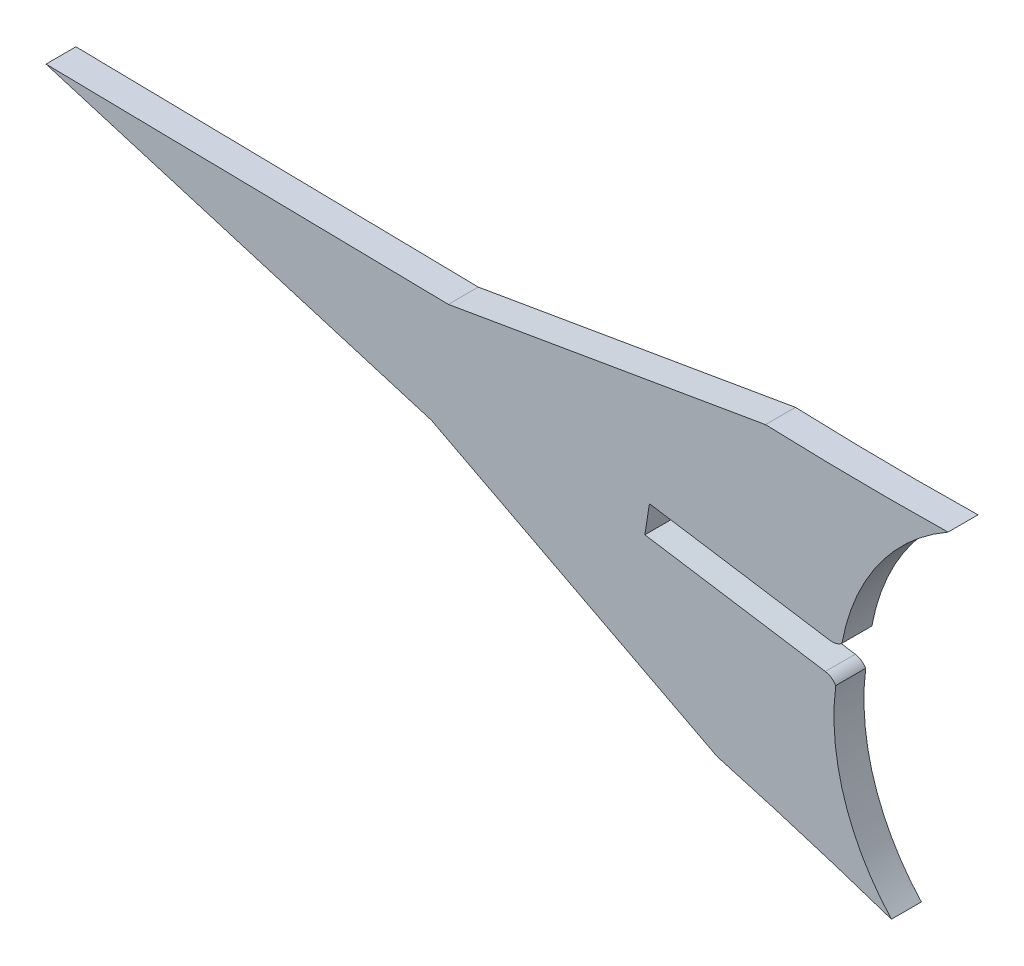
ISO-10303-21;
HEADER;
FILE_DESCRIPTION(('STEP AP214'),'2;1');
FILE_NAME('part.step','',(''),(''),'','','');
FILE_SCHEMA(('AUTOMOTIVE_DESIGN { 1 0 10303 214 1 1 1 1 }'));
ENDSEC;
DATA;
#1=APPLICATION_CONTEXT('core data for automotive mechanical design processes');
#2=APPLICATION_PROTOCOL_DEFINITION('international standard','automotive_design',2000,#1);
#3=PRODUCT_CONTEXT('',#1,'mechanical');
#4=PRODUCT('Part','Part','',(#3));
#5=PRODUCT_RELATED_PRODUCT_CATEGORY('part','',(#4));
#6=PRODUCT_DEFINITION_FORMATION('','',#4);
#7=PRODUCT_DEFINITION_CONTEXT('part definition',#1,'design');
#8=PRODUCT_DEFINITION('design','',#6,#7);
#9=PRODUCT_DEFINITION_SHAPE('','',#8);
#10=(LENGTH_UNIT() NAMED_UNIT(*) SI_UNIT(.MILLI.,.METRE.));
#11=(NAMED_UNIT(*) PLANE_ANGLE_UNIT() SI_UNIT($,.RADIAN.));
#12=(NAMED_UNIT(*) SI_UNIT($,.STERADIAN.) SOLID_ANGLE_UNIT());
#13=UNCERTAINTY_MEASURE_WITH_UNIT(LENGTH_MEASURE(1.E-05),#10,'distance_accuracy_value','');
#14=(GEOMETRIC_REPRESENTATION_CONTEXT(3) GLOBAL_UNCERTAINTY_ASSIGNED_CONTEXT((#13)) GLOBAL_UNIT_ASSIGNED_CONTEXT((#10,
#11,#12)) REPRESENTATION_CONTEXT('',''));
#15=CARTESIAN_POINT('',(0.,0.,0.));
#16=DIRECTION('',(0.,0.,1.));
#17=DIRECTION('',(1.,0.,0.));
#18=AXIS2_PLACEMENT_3D('',#15,#16,#17);
#19=CARTESIAN_POINT('',(252.079097865893,224.29847100034,1.524));
#20=DIRECTION('',(0.,0.,-1.));
#21=DIRECTION('',(-1.,0.,0.));
#22=AXIS2_PLACEMENT_3D('',#19,#20,#21);
#23=CYLINDRICAL_SURFACE('',#22,0.76200000000001);
#24=CARTESIAN_POINT('',(252.079097865893,224.29847100034,0.));
#25=DIRECTION('',(0.,0.,1.));
#26=DIRECTION('',(-1.,0.,0.));
#27=AXIS2_PLACEMENT_3D('',#24,#25,#26);
#28=CIRCLE('',#27,0.76200000000001);
#29=CARTESIAN_POINT('',(252.728179766503,224.697640997085,0.));
#30=VERTEX_POINT('',#29);
#31=CARTESIAN_POINT('',(252.196474719984,225.051376488515,0.));
#32=VERTEX_POINT('',#31);
#33=EDGE_CURVE('E158',#30,#32,#28,.T.);
#34=ORIENTED_EDGE('',*,*,#33,.T.);
#35=DIRECTION('',(0.,0.,-1.));
#36=VECTOR('',#35,1.);
#37=CARTESIAN_POINT('',(252.196474719984,225.051376488515,1.524));
#38=LINE('',#37,#36);
#39=CARTESIAN_POINT('',(252.196474719984,225.051376488515,1.524));
#40=VERTEX_POINT('',#39);
#41=EDGE_CURVE('E11',#40,#32,#38,.T.);
#42=ORIENTED_EDGE('',*,*,#41,.F.);
#43=CARTESIAN_POINT('',(252.079097865893,224.29847100034,1.524));
#44=DIRECTION('',(0.,0.,1.));
#45=DIRECTION('',(-1.,0.,0.));
#46=AXIS2_PLACEMENT_3D('',#43,#44,#45);
#47=CIRCLE('',#46,0.76200000000001);
#48=CARTESIAN_POINT('',(252.728179766503,224.697640997085,1.524));
#49=VERTEX_POINT('',#48);
#50=EDGE_CURVE('E182',#49,#40,#47,.T.);
#51=ORIENTED_EDGE('',*,*,#50,.F.);
#52=DIRECTION('',(0.,0.,-1.));
#53=VECTOR('',#52,1.);
#54=CARTESIAN_POINT('',(252.728179766503,224.697640997085,1.524));
#55=LINE('',#54,#53);
#56=EDGE_CURVE('E154',#49,#30,#55,.T.);
#57=ORIENTED_EDGE('',*,*,#56,.T.);
#58=EDGE_LOOP('',(#34,#42,#51,#57));
#59=FACE_BOUND('',#58,.T.);
#60=ADVANCED_FACE('F32',(#59),#23,.T.);
#61=CARTESIAN_POINT('',(243.009394748598,226.483628693146,1.524));
#62=DIRECTION('',(-0.154037866260265,-0.988064945111395,0.));
#63=DIRECTION('',(0.988064945111395,-0.154037866260265,0.));
#64=AXIS2_PLACEMENT_3D('',#61,#62,#63);
#65=PLANE('',#64);
#66=DIRECTION('',(-0.988064945111395,0.154037866260265,0.));
#67=VECTOR('',#66,1.);
#68=CARTESIAN_POINT('',(243.009394748598,226.483628693146,0.));
#69=LINE('',#68,#67);
#70=CARTESIAN_POINT('',(243.009394748598,226.483628693146,0.));
#71=VERTEX_POINT('',#70);
#72=EDGE_CURVE('E161',#32,#71,#69,.T.);
#73=ORIENTED_EDGE('',*,*,#72,.T.);
#74=DIRECTION('',(0.,0.,-1.));
#75=VECTOR('',#74,1.);
#76=CARTESIAN_POINT('',(243.009394748598,226.483628693146,1.524));
#77=LINE('',#76,#75);
#78=CARTESIAN_POINT('',(243.009394748598,226.483628693146,1.524));
#79=VERTEX_POINT('',#78);
#80=EDGE_CURVE('E40',#79,#71,#77,.T.);
#81=ORIENTED_EDGE('',*,*,#80,.F.);
#82=DIRECTION('',(-0.988064945111395,0.154037866260265,0.));
#83=VECTOR('',#82,1.);
#84=CARTESIAN_POINT('',(243.009394748598,226.483628693146,1.524));
#85=LINE('',#84,#83);
#86=EDGE_CURVE('E106',#40,#79,#85,.T.);
#87=ORIENTED_EDGE('',*,*,#86,.F.);
#88=ORIENTED_EDGE('',*,*,#41,.T.);
#89=EDGE_LOOP('',(#73,#81,#87,#88));
#90=FACE_BOUND('',#89,.T.);
#91=ADVANCED_FACE('F265',(#90),#65,.F.);
#92=CARTESIAN_POINT('',(243.009394748598,226.483628693146,1.524));
#93=DIRECTION('',(-0.98808512969779,0.153908337883631,0.));
#94=DIRECTION('',(-0.153908337883631,-0.98808512969779,0.));
#95=AXIS2_PLACEMENT_3D('',#92,#93,#94);
#96=PLANE('',#95);
#97=DIRECTION('',(0.153908337883631,0.98808512969779,0.));
#98=VECTOR('',#97,1.);
#99=CARTESIAN_POINT('',(243.009394748598,226.483628693146,0.));
#100=LINE('',#99,#98);
#101=CARTESIAN_POINT('',(243.241260725701,227.972198625155,0.));
#102=VERTEX_POINT('',#101);
#103=EDGE_CURVE('E163',#71,#102,#100,.T.);
#104=ORIENTED_EDGE('',*,*,#103,.T.);
#105=DIRECTION('',(0.,0.,-1.));
#106=VECTOR('',#105,1.);
#107=CARTESIAN_POINT('',(243.241260725701,227.972198625155,1.524));
#108=LINE('',#107,#106);
#109=CARTESIAN_POINT('',(243.241260725701,227.972198625155,1.524));
#110=VERTEX_POINT('',#109);
#111=EDGE_CURVE('E204',#110,#102,#108,.T.);
#112=ORIENTED_EDGE('',*,*,#111,.F.);
#113=DIRECTION('',(0.153908337883631,0.98808512969779,0.));
#114=VECTOR('',#113,1.);
#115=CARTESIAN_POINT('',(243.009394748598,226.483628693146,1.524));
#116=LINE('',#115,#114);
#117=EDGE_CURVE('E212',#79,#110,#116,.T.);
#118=ORIENTED_EDGE('',*,*,#117,.F.);
#119=ORIENTED_EDGE('',*,*,#80,.T.);
#120=EDGE_LOOP('',(#104,#112,#118,#119));
#121=FACE_BOUND('',#120,.T.);
#122=ADVANCED_FACE('F210',(#121),#96,.F.);
#123=CARTESIAN_POINT('',(243.241260725701,227.972198625155,1.524));
#124=DIRECTION('',(0.153778806862073,0.988105297303925,0.));
#125=DIRECTION('',(-0.988105297303925,0.153778806862073,0.));
#126=AXIS2_PLACEMENT_3D('',#123,#124,#125);
#127=PLANE('',#126);
#128=DIRECTION('',(0.988105297303924,-0.153778806862073,0.));
#129=VECTOR('',#128,1.);
#130=CARTESIAN_POINT('',(243.241260725701,227.972198625155,0.));
#131=LINE('',#130,#129);
#132=CARTESIAN_POINT('',(252.428715893902,226.542355168472,0.));
#133=VERTEX_POINT('',#132);
#134=EDGE_CURVE('E165',#102,#133,#131,.T.);
#135=ORIENTED_EDGE('',*,*,#134,.T.);
#136=DIRECTION('',(0.,0.,-1.));
#137=VECTOR('',#136,1.);
#138=CARTESIAN_POINT('',(252.428715893902,226.542355168472,1.524));
#139=LINE('',#138,#137);
#140=CARTESIAN_POINT('',(252.428715893902,226.542355168472,1.524));
#141=VERTEX_POINT('',#140);
#142=EDGE_CURVE('E201',#141,#133,#139,.T.);
#143=ORIENTED_EDGE('',*,*,#142,.F.);
#144=DIRECTION('',(0.988105297303924,-0.153778806862073,0.));
#145=VECTOR('',#144,1.);
#146=CARTESIAN_POINT('',(243.241260725701,227.972198625155,1.524));
#147=LINE('',#146,#145);
#148=EDGE_CURVE('E230',#110,#141,#147,.T.);
#149=ORIENTED_EDGE('',*,*,#148,.F.);
#150=ORIENTED_EDGE('',*,*,#111,.T.);
#151=EDGE_LOOP('',(#135,#143,#149,#150));
#152=FACE_BOUND('',#151,.T.);
#153=ADVANCED_FACE('F221',(#152),#127,.F.);
#154=CARTESIAN_POINT('',(252.545895344731,227.295291405017,1.524));
#155=DIRECTION('',(0.,0.,-1.));
#156=DIRECTION('',(-1.,0.,0.));
#157=AXIS2_PLACEMENT_3D('',#154,#155,#156);
#158=CYLINDRICAL_SURFACE('',#157,0.762000000000013);
#159=CARTESIAN_POINT('',(252.545895344731,227.295291405017,0.));
#160=DIRECTION('',(0.,0.,1.));
#161=DIRECTION('',(1.,0.,0.));
#162=AXIS2_PLACEMENT_3D('',#159,#160,#161);
#163=CIRCLE('',#162,0.762000000000013);
#164=CARTESIAN_POINT('',(253.042819444123,226.717614644671,0.));
#165=VERTEX_POINT('',#164);
#166=EDGE_CURVE('E167',#133,#165,#163,.T.);
#167=ORIENTED_EDGE('',*,*,#166,.T.);
#168=DIRECTION('',(0.,0.,-1.));
#169=VECTOR('',#168,1.);
#170=CARTESIAN_POINT('',(253.042819444123,226.717614644671,1.524));
#171=LINE('',#170,#169);
#172=CARTESIAN_POINT('',(253.042819444123,226.717614644671,1.524));
#173=VERTEX_POINT('',#172);
#174=EDGE_CURVE('E198',#173,#165,#171,.T.);
#175=ORIENTED_EDGE('',*,*,#174,.F.);
#176=CARTESIAN_POINT('',(252.545895344731,227.295291405017,1.524));
#177=DIRECTION('',(0.,0.,1.));
#178=DIRECTION('',(1.,0.,0.));
#179=AXIS2_PLACEMENT_3D('',#176,#177,#178);
#180=CIRCLE('',#179,0.762000000000013);
#181=EDGE_CURVE('E227',#141,#173,#180,.T.);
#182=ORIENTED_EDGE('',*,*,#181,.F.);
#183=ORIENTED_EDGE('',*,*,#142,.T.);
#184=EDGE_LOOP('',(#167,#175,#182,#183));
#185=FACE_BOUND('',#184,.T.);
#186=ADVANCED_FACE('F225',(#185),#158,.T.);
#187=CARTESIAN_POINT('',(263.885158278804,224.734496792459,1.524));
#188=DIRECTION('',(0.,0.,-1.));
#189=DIRECTION('',(-1.,0.,0.));
#190=AXIS2_PLACEMENT_3D('',#187,#188,#189);
#191=CYLINDRICAL_SURFACE('',#190,11.0222079376955);
#192=CARTESIAN_POINT('',(263.885158278804,224.734496792459,0.));
#193=DIRECTION('',(0.,0.,-1.));
#194=DIRECTION('',(-1.,0.,0.));
#195=AXIS2_PLACEMENT_3D('',#192,#193,#194);
#196=CIRCLE('',#195,11.0222079376955);
#197=CARTESIAN_POINT('',(258.445341479294,234.320813134494,0.));
#198=VERTEX_POINT('',#197);
#199=EDGE_CURVE('E169',#165,#198,#196,.T.);
#200=ORIENTED_EDGE('',*,*,#199,.T.);
#201=DIRECTION('',(0.,0.,-1.));
#202=VECTOR('',#201,1.);
#203=CARTESIAN_POINT('',(258.445341479294,234.320813134494,1.524));
#204=LINE('',#203,#202);
#205=CARTESIAN_POINT('',(258.445341479294,234.320813134494,1.524));
#206=VERTEX_POINT('',#205);
#207=EDGE_CURVE('E195',#206,#198,#204,.T.);
#208=ORIENTED_EDGE('',*,*,#207,.F.);
#209=CARTESIAN_POINT('',(263.885158278804,224.734496792459,1.524));
#210=DIRECTION('',(0.,0.,-1.));
#211=DIRECTION('',(-1.,0.,0.));
#212=AXIS2_PLACEMENT_3D('',#209,#210,#211);
#213=CIRCLE('',#212,11.0222079376955);
#214=EDGE_CURVE('E229',#173,#206,#213,.T.);
#215=ORIENTED_EDGE('',*,*,#214,.F.);
#216=ORIENTED_EDGE('',*,*,#174,.T.);
#217=EDGE_LOOP('',(#200,#208,#215,#216));
#218=FACE_BOUND('',#217,.T.);
#219=ADVANCED_FACE('F278',(#218),#191,.F.);
#220=CARTESIAN_POINT('',(255.464366720967,401.084428898989,1.524));
#221=DIRECTION('',(0.,0.,-1.));
#222=DIRECTION('',(-1.,0.,0.));
#223=AXIS2_PLACEMENT_3D('',#220,#221,#222);
#224=CYLINDRICAL_SURFACE('',#223,166.790256769866);
#225=CARTESIAN_POINT('',(255.464366720967,401.084428898989,0.));
#226=DIRECTION('',(0.,0.,-1.));
#227=DIRECTION('',(-1.,0.,0.));
#228=AXIS2_PLACEMENT_3D('',#225,#226,#227);
#229=CIRCLE('',#228,166.790256769866);
#230=CARTESIAN_POINT('',(249.153153431749,234.413620596587,0.));
#231=VERTEX_POINT('',#230);
#232=EDGE_CURVE('E171',#198,#231,#229,.T.);
#233=ORIENTED_EDGE('',*,*,#232,.T.);
#234=DIRECTION('',(0.,0.,-1.));
#235=VECTOR('',#234,1.);
#236=CARTESIAN_POINT('',(249.153153431749,234.413620596587,1.524));
#237=LINE('',#236,#235);
#238=CARTESIAN_POINT('',(249.153153431749,234.413620596587,1.524));
#239=VERTEX_POINT('',#238);
#240=EDGE_CURVE('E192',#239,#231,#237,.T.);
#241=ORIENTED_EDGE('',*,*,#240,.F.);
#242=CARTESIAN_POINT('',(255.464366720967,401.084428898989,1.524));
#243=DIRECTION('',(0.,0.,-1.));
#244=DIRECTION('',(-1.,0.,0.));
#245=AXIS2_PLACEMENT_3D('',#242,#243,#244);
#246=CIRCLE('',#245,166.790256769866);
#247=EDGE_CURVE('E232',#206,#239,#246,.T.);
#248=ORIENTED_EDGE('',*,*,#247,.F.);
#249=ORIENTED_EDGE('',*,*,#207,.T.);
#250=EDGE_LOOP('',(#233,#241,#248,#249));
#251=FACE_BOUND('',#250,.T.);
#252=ADVANCED_FACE('F281',(#251),#224,.F.);
#253=CARTESIAN_POINT('',(249.153153431749,234.413620596587,1.524));
#254=DIRECTION('',(0.169167759487587,-0.985587271199233,0.));
#255=DIRECTION('',(0.985587271199233,0.169167759487587,0.));
#256=AXIS2_PLACEMENT_3D('',#253,#254,#255);
#257=PLANE('',#256);
#258=DIRECTION('',(-0.985587271199233,-0.169167759487587,0.));
#259=VECTOR('',#258,1.);
#260=CARTESIAN_POINT('',(249.153153431749,234.413620596587,0.));
#261=LINE('',#260,#259);
#262=CARTESIAN_POINT('',(233.004487140505,231.641837949802,0.));
#263=VERTEX_POINT('',#262);
#264=EDGE_CURVE('E173',#231,#263,#261,.T.);
#265=ORIENTED_EDGE('',*,*,#264,.T.);
#266=DIRECTION('',(0.,0.,-1.));
#267=VECTOR('',#266,1.);
#268=CARTESIAN_POINT('',(233.004487140505,231.641837949802,1.524));
#269=LINE('',#268,#267);
#270=CARTESIAN_POINT('',(233.004487140505,231.641837949802,1.524));
#271=VERTEX_POINT('',#270);
#272=EDGE_CURVE('E189',#271,#263,#269,.T.);
#273=ORIENTED_EDGE('',*,*,#272,.F.);
#274=DIRECTION('',(-0.985587271199233,-0.169167759487587,0.));
#275=VECTOR('',#274,1.);
#276=CARTESIAN_POINT('',(249.153153431749,234.413620596587,1.524));
#277=LINE('',#276,#275);
#278=EDGE_CURVE('E238',#239,#271,#277,.T.);
#279=ORIENTED_EDGE('',*,*,#278,.F.);
#280=ORIENTED_EDGE('',*,*,#240,.T.);
#281=EDGE_LOOP('',(#265,#273,#279,#280));
#282=FACE_BOUND('',#281,.T.);
#283=ADVANCED_FACE('F285',(#282),#257,.F.);
#284=CARTESIAN_POINT('',(212.52124405688,231.994935760903,1.524));
#285=DIRECTION('',(-0.0172358135771253,-0.999851452331962,0.));
#286=DIRECTION('',(0.999851452331963,-0.0172358135771253,0.));
#287=AXIS2_PLACEMENT_3D('',#284,#285,#286);
#288=PLANE('',#287);
#289=DIRECTION('',(-0.999851452331962,0.0172358135771253,0.));
#290=VECTOR('',#289,1.);
#291=CARTESIAN_POINT('',(212.52124405688,231.994935760903,0.));
#292=LINE('',#291,#290);
#293=CARTESIAN_POINT('',(212.52124405688,231.994935760903,0.));
#294=VERTEX_POINT('',#293);
#295=EDGE_CURVE('E175',#263,#294,#292,.T.);
#296=ORIENTED_EDGE('',*,*,#295,.T.);
#297=DIRECTION('',(0.,0.,-1.));
#298=VECTOR('',#297,1.);
#299=CARTESIAN_POINT('',(212.52124405688,231.994935760903,1.524));
#300=LINE('',#299,#298);
#301=CARTESIAN_POINT('',(212.52124405688,231.994935760903,1.524));
#302=VERTEX_POINT('',#301);
#303=EDGE_CURVE('E186',#302,#294,#300,.T.);
#304=ORIENTED_EDGE('',*,*,#303,.F.);
#305=DIRECTION('',(-0.999851452331962,0.0172358135771253,0.));
#306=VECTOR('',#305,1.);
#307=CARTESIAN_POINT('',(212.52124405688,231.994935760903,1.524));
#308=LINE('',#307,#306);
#309=EDGE_CURVE('E240',#271,#302,#308,.T.);
#310=ORIENTED_EDGE('',*,*,#309,.F.);
#311=ORIENTED_EDGE('',*,*,#272,.T.);
#312=EDGE_LOOP('',(#296,#304,#310,#311));
#313=FACE_BOUND('',#312,.T.);
#314=ADVANCED_FACE('F246',(#313),#288,.F.);
#315=CARTESIAN_POINT('',(212.52124405688,231.994935760903,1.524));
#316=DIRECTION('',(0.28768464198353,0.957725193762181,0.));
#317=DIRECTION('',(-0.957725193762181,0.28768464198353,0.));
#318=AXIS2_PLACEMENT_3D('',#315,#316,#317);
#319=PLANE('',#318);
#320=DIRECTION('',(0.957725193762181,-0.28768464198353,0.));
#321=VECTOR('',#320,1.);
#322=CARTESIAN_POINT('',(212.52124405688,231.994935760903,0.));
#323=LINE('',#322,#321);
#324=CARTESIAN_POINT('',(232.141476547806,226.101345828688,0.));
#325=VERTEX_POINT('',#324);
#326=EDGE_CURVE('E177',#294,#325,#323,.T.);
#327=ORIENTED_EDGE('',*,*,#326,.T.);
#328=DIRECTION('',(0.,0.,-1.));
#329=VECTOR('',#328,1.);
#330=CARTESIAN_POINT('',(232.141476547806,226.101345828688,1.524));
#331=LINE('',#330,#329);
#332=CARTESIAN_POINT('',(232.141476547806,226.101345828688,1.524));
#333=VERTEX_POINT('',#332);
#334=EDGE_CURVE('E149',#333,#325,#331,.T.);
#335=ORIENTED_EDGE('',*,*,#334,.F.);
#336=DIRECTION('',(0.957725193762181,-0.28768464198353,0.));
#337=VECTOR('',#336,1.);
#338=CARTESIAN_POINT('',(212.52124405688,231.994935760903,1.524));
#339=LINE('',#338,#337);
#340=EDGE_CURVE('E140',#302,#333,#339,.T.);
#341=ORIENTED_EDGE('',*,*,#340,.F.);
#342=ORIENTED_EDGE('',*,*,#303,.T.);
#343=EDGE_LOOP('',(#327,#335,#341,#342));
#344=FACE_BOUND('',#343,.T.);
#345=ADVANCED_FACE('F250',(#344),#319,.F.);
#346=CARTESIAN_POINT('',(246.682055702279,218.549275921737,1.524));
#347=DIRECTION('',(0.460918805135818,0.887442310841764,0.));
#348=DIRECTION('',(-0.887442310841764,0.460918805135818,0.));
#349=AXIS2_PLACEMENT_3D('',#346,#347,#348);
#350=PLANE('',#349);
#351=DIRECTION('',(0.887442310841764,-0.460918805135818,0.));
#352=VECTOR('',#351,1.);
#353=CARTESIAN_POINT('',(246.682055702279,218.549275921737,0.));
#354=LINE('',#353,#352);
#355=CARTESIAN_POINT('',(246.682055702279,218.549275921737,0.));
#356=VERTEX_POINT('',#355);
#357=EDGE_CURVE('E148',#325,#356,#354,.T.);
#358=ORIENTED_EDGE('',*,*,#357,.T.);
#359=DIRECTION('',(0.,0.,-1.));
#360=VECTOR('',#359,1.);
#361=CARTESIAN_POINT('',(246.682055702279,218.549275921737,1.524));
#362=LINE('',#361,#360);
#363=CARTESIAN_POINT('',(246.682055702279,218.549275921737,1.524));
#364=VERTEX_POINT('',#363);
#365=EDGE_CURVE('E145',#364,#356,#362,.T.);
#366=ORIENTED_EDGE('',*,*,#365,.F.);
#367=DIRECTION('',(0.887442310841764,-0.460918805135818,0.));
#368=VECTOR('',#367,1.);
#369=CARTESIAN_POINT('',(246.682055702279,218.549275921737,1.524));
#370=LINE('',#369,#368);
#371=EDGE_CURVE('E134',#333,#364,#370,.T.);
#372=ORIENTED_EDGE('',*,*,#371,.F.);
#373=ORIENTED_EDGE('',*,*,#334,.T.);
#374=EDGE_LOOP('',(#358,#366,#372,#373));
#375=FACE_BOUND('',#374,.T.);
#376=ADVANCED_FACE('F146',(#375),#350,.F.);
#377=CARTESIAN_POINT('',(202.001498764392,57.855039606062,1.524));
#378=DIRECTION('',(0.,0.,-1.));
#379=DIRECTION('',(-1.,0.,0.));
#380=AXIS2_PLACEMENT_3D('',#377,#378,#379);
#381=CYLINDRICAL_SURFACE('',#380,166.790256769866);
#382=CARTESIAN_POINT('',(202.001498764392,57.855039606062,0.));
#383=DIRECTION('',(0.,0.,-1.));
#384=DIRECTION('',(1.,0.,0.));
#385=AXIS2_PLACEMENT_3D('',#382,#383,#384);
#386=CIRCLE('',#385,166.790256769866);
#387=CARTESIAN_POINT('',(255.56224850726,215.811476133162,0.));
#388=VERTEX_POINT('',#387);
#389=EDGE_CURVE('E92',#356,#388,#386,.T.);
#390=ORIENTED_EDGE('',*,*,#389,.T.);
#391=DIRECTION('',(0.,0.,-1.));
#392=VECTOR('',#391,1.);
#393=CARTESIAN_POINT('',(255.56224850726,215.811476133162,1.524));
#394=LINE('',#393,#392);
#395=CARTESIAN_POINT('',(255.56224850726,215.811476133162,1.524));
#396=VERTEX_POINT('',#395);
#397=EDGE_CURVE('E150',#396,#388,#394,.T.);
#398=ORIENTED_EDGE('',*,*,#397,.F.);
#399=CARTESIAN_POINT('',(202.001498764392,57.855039606062,1.524));
#400=DIRECTION('',(0.,0.,-1.));
#401=DIRECTION('',(1.,0.,0.));
#402=AXIS2_PLACEMENT_3D('',#399,#400,#401);
#403=CIRCLE('',#402,166.790256769866);
#404=EDGE_CURVE('E138',#364,#396,#403,.T.);
#405=ORIENTED_EDGE('',*,*,#404,.F.);
#406=ORIENTED_EDGE('',*,*,#365,.T.);
#407=EDGE_LOOP('',(#390,#398,#405,#406));
#408=FACE_BOUND('',#407,.T.);
#409=ADVANCED_FACE('F152',(#408),#381,.F.);
#410=CARTESIAN_POINT('',(263.660020274005,223.289120162902,1.524));
#411=DIRECTION('',(0.,0.,-1.));
#412=DIRECTION('',(-1.,0.,0.));
#413=AXIS2_PLACEMENT_3D('',#410,#411,#412);
#414=CYLINDRICAL_SURFACE('',#413,11.0222079376954);
#415=CARTESIAN_POINT('',(263.660020274005,223.289120162902,0.));
#416=DIRECTION('',(0.,0.,-1.));
#417=DIRECTION('',(1.,0.,0.));
#418=AXIS2_PLACEMENT_3D('',#415,#416,#417);
#419=CIRCLE('',#418,11.0222079376954);
#420=EDGE_CURVE('E98',#388,#30,#419,.T.);
#421=ORIENTED_EDGE('',*,*,#420,.T.);
#422=ORIENTED_EDGE('',*,*,#56,.F.);
#423=CARTESIAN_POINT('',(263.660020274005,223.289120162902,1.524));
#424=DIRECTION('',(0.,0.,-1.));
#425=DIRECTION('',(1.,0.,0.));
#426=AXIS2_PLACEMENT_3D('',#423,#424,#425);
#427=CIRCLE('',#426,11.0222079376954);
#428=EDGE_CURVE('E48',#396,#49,#427,.T.);
#429=ORIENTED_EDGE('',*,*,#428,.F.);
#430=ORIENTED_EDGE('',*,*,#397,.T.);
#431=EDGE_LOOP('',(#421,#422,#429,#430));
#432=FACE_BOUND('',#431,.T.);
#433=ADVANCED_FACE('F254',(#432),#414,.F.);
#434=CARTESIAN_POINT('',(252.079097865893,224.29847100034,1.524));
#435=DIRECTION('',(0.,0.,-1.));
#436=DIRECTION('',(-1.,0.,0.));
#437=AXIS2_PLACEMENT_3D('',#434,#435,#436);
#438=PLANE('',#437);
#439=ORIENTED_EDGE('',*,*,#50,.T.);
#440=ORIENTED_EDGE('',*,*,#86,.T.);
#441=ORIENTED_EDGE('',*,*,#117,.T.);
#442=ORIENTED_EDGE('',*,*,#148,.T.);
#443=ORIENTED_EDGE('',*,*,#181,.T.);
#444=ORIENTED_EDGE('',*,*,#214,.T.);
#445=ORIENTED_EDGE('',*,*,#247,.T.);
#446=ORIENTED_EDGE('',*,*,#278,.T.);
#447=ORIENTED_EDGE('',*,*,#309,.T.);
#448=ORIENTED_EDGE('',*,*,#340,.T.);
#449=ORIENTED_EDGE('',*,*,#371,.T.);
#450=ORIENTED_EDGE('',*,*,#404,.T.);
#451=ORIENTED_EDGE('',*,*,#428,.T.);
#452=EDGE_LOOP('',(#439,#440,#441,#442,#443,#444,#445,#446,#447,#448,#449,#450,#451));
#453=FACE_BOUND('',#452,.T.);
#454=ADVANCED_FACE('F136',(#453),#438,.F.);
#455=CARTESIAN_POINT('',(252.079097865893,224.29847100034,0.));
#456=DIRECTION('',(0.,0.,-1.));
#457=DIRECTION('',(-1.,0.,0.));
#458=AXIS2_PLACEMENT_3D('',#455,#456,#457);
#459=PLANE('',#458);
#460=ORIENTED_EDGE('',*,*,#33,.F.);
#461=ORIENTED_EDGE('',*,*,#420,.F.);
#462=ORIENTED_EDGE('',*,*,#389,.F.);
#463=ORIENTED_EDGE('',*,*,#357,.F.);
#464=ORIENTED_EDGE('',*,*,#326,.F.);
#465=ORIENTED_EDGE('',*,*,#295,.F.);
#466=ORIENTED_EDGE('',*,*,#264,.F.);
#467=ORIENTED_EDGE('',*,*,#232,.F.);
#468=ORIENTED_EDGE('',*,*,#199,.F.);
#469=ORIENTED_EDGE('',*,*,#166,.F.);
#470=ORIENTED_EDGE('',*,*,#134,.F.);
#471=ORIENTED_EDGE('',*,*,#103,.F.);
#472=ORIENTED_EDGE('',*,*,#72,.F.);
#473=EDGE_LOOP('',(#460,#461,#462,#463,#464,#465,#466,#467,#468,#469,#470,#471,#472));
#474=FACE_BOUND('',#473,.T.);
#475=ADVANCED_FACE('F216',(#474),#459,.T.);
#476=CLOSED_SHELL('',(#60,#91,#122,#153,#186,#219,#252,#283,#314,#345,#376,#409,#433,#454,#475));
#477=MANIFOLD_SOLID_BREP('B2',#476);
#478=ADVANCED_BREP_SHAPE_REPRESENTATION('',(#18,#477),#14);
#479=SHAPE_DEFINITION_REPRESENTATION(#9,#478);
ENDSEC;
END-ISO-10303-21;
